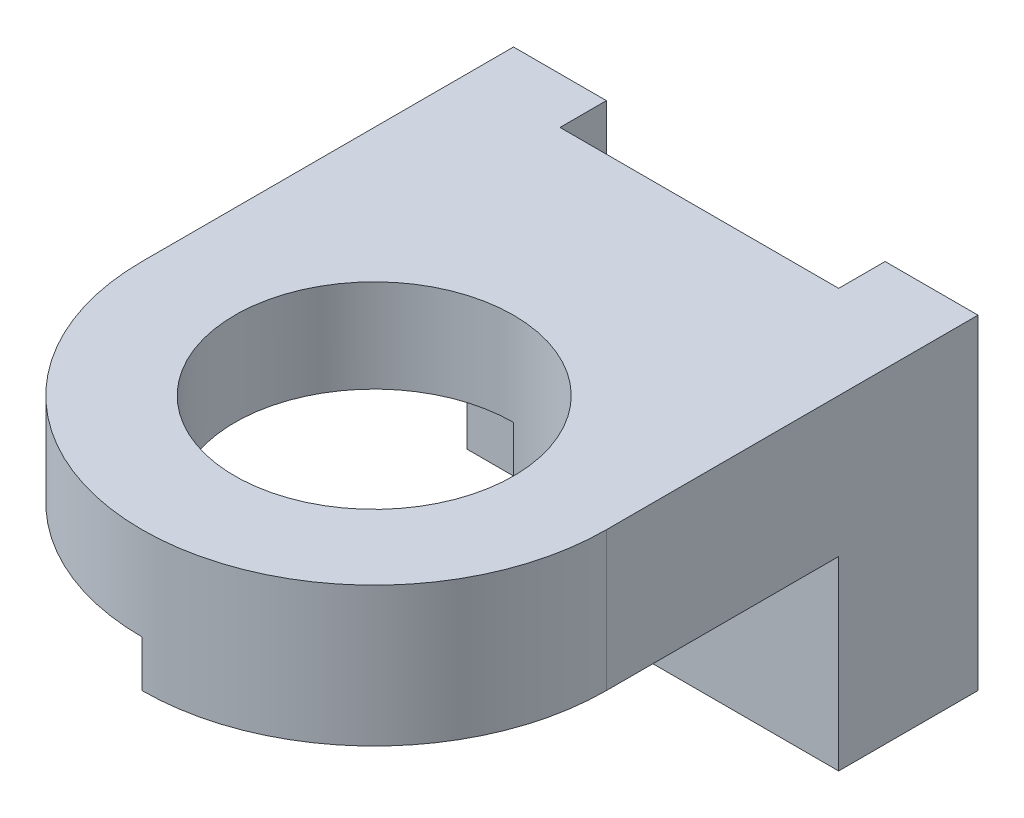
ISO-10303-21;
HEADER;
FILE_DESCRIPTION(('STEP AP214'),'2;1');
FILE_NAME('part.step','',(''),(''),'','','');
FILE_SCHEMA(('AUTOMOTIVE_DESIGN { 1 0 10303 214 1 1 1 1 }'));
ENDSEC;
DATA;
#1=APPLICATION_CONTEXT('core data for automotive mechanical design processes');
#2=APPLICATION_PROTOCOL_DEFINITION('international standard','automotive_design',2000,#1);
#3=PRODUCT_CONTEXT('',#1,'mechanical');
#4=PRODUCT('Part','Part','',(#3));
#5=PRODUCT_RELATED_PRODUCT_CATEGORY('part','',(#4));
#6=PRODUCT_DEFINITION_FORMATION('','',#4);
#7=PRODUCT_DEFINITION_CONTEXT('part definition',#1,'design');
#8=PRODUCT_DEFINITION('design','',#6,#7);
#9=PRODUCT_DEFINITION_SHAPE('','',#8);
#10=(LENGTH_UNIT() NAMED_UNIT(*) SI_UNIT(.MILLI.,.METRE.));
#11=(NAMED_UNIT(*) PLANE_ANGLE_UNIT() SI_UNIT($,.RADIAN.));
#12=(NAMED_UNIT(*) SI_UNIT($,.STERADIAN.) SOLID_ANGLE_UNIT());
#13=UNCERTAINTY_MEASURE_WITH_UNIT(LENGTH_MEASURE(1.E-05),#10,'distance_accuracy_value','');
#14=(GEOMETRIC_REPRESENTATION_CONTEXT(3) GLOBAL_UNCERTAINTY_ASSIGNED_CONTEXT((#13)) GLOBAL_UNIT_ASSIGNED_CONTEXT((#10,
#11,#12)) REPRESENTATION_CONTEXT('',''));
#15=CARTESIAN_POINT('',(0.,0.,0.));
#16=DIRECTION('',(0.,0.,1.));
#17=DIRECTION('',(1.,0.,0.));
#18=AXIS2_PLACEMENT_3D('',#15,#16,#17);
#19=CARTESIAN_POINT('',(0.,0.,0.));
#20=DIRECTION('',(0.,0.,-1.));
#21=DIRECTION('',(-1.,0.,0.));
#22=AXIS2_PLACEMENT_3D('',#19,#20,#21);
#23=PLANE('',#22);
#24=DIRECTION('',(-1.,0.,0.));
#25=VECTOR('',#24,1.);
#26=CARTESIAN_POINT('',(0.,70.,0.));
#27=LINE('',#26,#25);
#28=CARTESIAN_POINT('',(20.,70.,0.));
#29=VERTEX_POINT('',#28);
#30=CARTESIAN_POINT('',(0.,70.,0.));
#31=VERTEX_POINT('',#30);
#32=EDGE_CURVE('E178',#29,#31,#27,.T.);
#33=ORIENTED_EDGE('',*,*,#32,.F.);
#34=DIRECTION('',(0.,1.,0.));
#35=VECTOR('',#34,1.);
#36=CARTESIAN_POINT('',(20.,-70.,0.));
#37=LINE('',#36,#35);
#38=CARTESIAN_POINT('',(20.,20.,0.));
#39=VERTEX_POINT('',#38);
#40=EDGE_CURVE('E161',#39,#29,#37,.T.);
#41=ORIENTED_EDGE('',*,*,#40,.F.);
#42=DIRECTION('',(-1.,0.,0.));
#43=VECTOR('',#42,1.);
#44=CARTESIAN_POINT('',(0.,20.,0.));
#45=LINE('',#44,#43);
#46=CARTESIAN_POINT('',(0.,20.,0.));
#47=VERTEX_POINT('',#46);
#48=EDGE_CURVE('E267',#39,#47,#45,.T.);
#49=ORIENTED_EDGE('',*,*,#48,.T.);
#50=DIRECTION('',(0.,-1.,0.));
#51=VECTOR('',#50,1.);
#52=CARTESIAN_POINT('',(0.,0.,0.));
#53=LINE('',#52,#51);
#54=EDGE_CURVE('E182',#31,#47,#53,.T.);
#55=ORIENTED_EDGE('',*,*,#54,.F.);
#56=EDGE_LOOP('',(#33,#41,#49,#55));
#57=FACE_BOUND('',#56,.T.);
#58=ADVANCED_FACE('F35',(#57),#23,.T.);
#59=CARTESIAN_POINT('',(0.,0.,40.));
#60=DIRECTION('',(0.,0.,-1.));
#61=DIRECTION('',(-1.,0.,0.));
#62=AXIS2_PLACEMENT_3D('',#59,#60,#61);
#63=PLANE('',#62);
#64=DIRECTION('',(0.,1.,0.));
#65=VECTOR('',#64,1.);
#66=CARTESIAN_POINT('',(49.9999999999997,40.,40.));
#67=LINE('',#66,#65);
#68=CARTESIAN_POINT('',(49.9999999999997,40.,40.));
#69=VERTEX_POINT('',#68);
#70=CARTESIAN_POINT('',(49.9999999999997,50.,40.));
#71=VERTEX_POINT('',#70);
#72=EDGE_CURVE('E357',#69,#71,#67,.T.);
#73=ORIENTED_EDGE('',*,*,#72,.T.);
#74=DIRECTION('',(-1.,0.,0.));
#75=VECTOR('',#74,1.);
#76=CARTESIAN_POINT('',(100.,50.,40.));
#77=LINE('',#76,#75);
#78=CARTESIAN_POINT('',(30.,50.,40.));
#79=VERTEX_POINT('',#78);
#80=EDGE_CURVE('E213',#71,#79,#77,.T.);
#81=ORIENTED_EDGE('',*,*,#80,.T.);
#82=DIRECTION('',(0.,-1.,0.));
#83=VECTOR('',#82,1.);
#84=CARTESIAN_POINT('',(30.,0.,40.));
#85=LINE('',#84,#83);
#86=CARTESIAN_POINT('',(30.,40.,40.));
#87=VERTEX_POINT('',#86);
#88=EDGE_CURVE('E219',#79,#87,#85,.T.);
#89=ORIENTED_EDGE('',*,*,#88,.T.);
#90=DIRECTION('',(1.,0.,0.));
#91=VECTOR('',#90,1.);
#92=CARTESIAN_POINT('',(100.,40.,40.));
#93=LINE('',#92,#91);
#94=EDGE_CURVE('E210',#87,#69,#93,.T.);
#95=ORIENTED_EDGE('',*,*,#94,.T.);
#96=EDGE_LOOP('',(#73,#81,#89,#95));
#97=FACE_BOUND('',#96,.T.);
#98=ADVANCED_FACE('F356',(#97),#63,.F.);
#99=CARTESIAN_POINT('',(0.,50.,0.));
#100=DIRECTION('',(0.,1.,0.));
#101=DIRECTION('',(0.,0.,1.));
#102=AXIS2_PLACEMENT_3D('',#99,#100,#101);
#103=PLANE('',#102);
#104=DIRECTION('',(0.,0.,-1.));
#105=VECTOR('',#104,1.);
#106=CARTESIAN_POINT('',(50.,50.,110.));
#107=LINE('',#106,#105);
#108=CARTESIAN_POINT('',(50.,50.,130.));
#109=VERTEX_POINT('',#108);
#110=CARTESIAN_POINT('',(50.,50.,110.));
#111=VERTEX_POINT('',#110);
#112=EDGE_CURVE('E306',#109,#111,#107,.T.);
#113=ORIENTED_EDGE('',*,*,#112,.F.);
#114=CARTESIAN_POINT('',(50.,50.,80.));
#115=DIRECTION('',(0.,-1.,0.));
#116=DIRECTION('',(0.,0.,-1.));
#117=AXIS2_PLACEMENT_3D('',#114,#115,#116);
#118=CIRCLE('',#117,50.);
#119=CARTESIAN_POINT('',(0.,50.,80.));
#120=VERTEX_POINT('',#119);
#121=EDGE_CURVE('E303',#120,#109,#118,.F.);
#122=ORIENTED_EDGE('',*,*,#121,.F.);
#123=DIRECTION('',(0.,0.,1.));
#124=VECTOR('',#123,1.);
#125=CARTESIAN_POINT('',(0.,50.,0.));
#126=LINE('',#125,#124);
#127=CARTESIAN_POINT('',(0.,50.,10.));
#128=VERTEX_POINT('',#127);
#129=EDGE_CURVE('E195',#128,#120,#126,.T.);
#130=ORIENTED_EDGE('',*,*,#129,.F.);
#131=DIRECTION('',(-0.707106781186547,0.,-0.707106781186547));
#132=VECTOR('',#131,1.);
#133=CARTESIAN_POINT('',(0.,50.,10.));
#134=LINE('',#133,#132);
#135=EDGE_CURVE('E188',#79,#128,#134,.T.);
#136=ORIENTED_EDGE('',*,*,#135,.F.);
#137=ORIENTED_EDGE('',*,*,#80,.F.);
#138=DIRECTION('',(0.,0.,-1.));
#139=VECTOR('',#138,1.);
#140=CARTESIAN_POINT('',(49.9999999999997,50.,40.));
#141=LINE('',#140,#139);
#142=CARTESIAN_POINT('',(50.,50.,50.));
#143=VERTEX_POINT('',#142);
#144=EDGE_CURVE('E359',#143,#71,#141,.T.);
#145=ORIENTED_EDGE('',*,*,#144,.F.);
#146=CARTESIAN_POINT('',(50.,50.,80.));
#147=DIRECTION('',(0.,-1.,0.));
#148=DIRECTION('',(0.,0.,-1.));
#149=AXIS2_PLACEMENT_3D('',#146,#147,#148);
#150=CIRCLE('',#149,30.);
#151=EDGE_CURVE('E324',#111,#143,#150,.T.);
#152=ORIENTED_EDGE('',*,*,#151,.F.);
#153=EDGE_LOOP('',(#113,#122,#130,#136,#137,#145,#152));
#154=FACE_BOUND('',#153,.T.);
#155=ADVANCED_FACE('F300',(#154),#103,.F.);
#156=CARTESIAN_POINT('',(100.,0.,30.));
#157=DIRECTION('',(-1.,0.,0.));
#158=DIRECTION('',(0.,0.,1.));
#159=AXIS2_PLACEMENT_3D('',#156,#157,#158);
#160=PLANE('',#159);
#161=DIRECTION('',(0.,-1.,0.));
#162=VECTOR('',#161,1.);
#163=CARTESIAN_POINT('',(100.,70.,80.));
#164=LINE('',#163,#162);
#165=CARTESIAN_POINT('',(100.,70.,80.));
#166=VERTEX_POINT('',#165);
#167=CARTESIAN_POINT('',(100.,40.,80.));
#168=VERTEX_POINT('',#167);
#169=EDGE_CURVE('E320',#166,#168,#164,.T.);
#170=ORIENTED_EDGE('',*,*,#169,.T.);
#171=DIRECTION('',(0.,0.,-1.));
#172=VECTOR('',#171,1.);
#173=CARTESIAN_POINT('',(100.,40.,40.));
#174=LINE('',#173,#172);
#175=CARTESIAN_POINT('',(100.,40.,30.));
#176=VERTEX_POINT('',#175);
#177=EDGE_CURVE('E229',#168,#176,#174,.T.);
#178=ORIENTED_EDGE('',*,*,#177,.T.);
#179=DIRECTION('',(0.,1.,0.));
#180=VECTOR('',#179,1.);
#181=CARTESIAN_POINT('',(100.,0.,30.));
#182=LINE('',#181,#180);
#183=CARTESIAN_POINT('',(100.,0.,30.));
#184=VERTEX_POINT('',#183);
#185=EDGE_CURVE('E254',#184,#176,#182,.T.);
#186=ORIENTED_EDGE('',*,*,#185,.F.);
#187=DIRECTION('',(0.,0.,-1.));
#188=VECTOR('',#187,1.);
#189=CARTESIAN_POINT('',(100.,0.,30.));
#190=LINE('',#189,#188);
#191=CARTESIAN_POINT('',(100.,0.,0.));
#192=VERTEX_POINT('',#191);
#193=EDGE_CURVE('E251',#184,#192,#190,.T.);
#194=ORIENTED_EDGE('',*,*,#193,.T.);
#195=DIRECTION('',(0.,1.,0.));
#196=VECTOR('',#195,1.);
#197=CARTESIAN_POINT('',(100.,0.,0.));
#198=LINE('',#197,#196);
#199=CARTESIAN_POINT('',(100.,70.,0.));
#200=VERTEX_POINT('',#199);
#201=EDGE_CURVE('E243',#192,#200,#198,.T.);
#202=ORIENTED_EDGE('',*,*,#201,.T.);
#203=DIRECTION('',(0.,0.,-1.));
#204=VECTOR('',#203,1.);
#205=CARTESIAN_POINT('',(100.,70.,0.));
#206=LINE('',#205,#204);
#207=EDGE_CURVE('E185',#166,#200,#206,.T.);
#208=ORIENTED_EDGE('',*,*,#207,.F.);
#209=EDGE_LOOP('',(#170,#178,#186,#194,#202,#208));
#210=FACE_BOUND('',#209,.T.);
#211=ADVANCED_FACE('F330',(#210),#160,.F.);
#212=CARTESIAN_POINT('',(0.,0.,30.));
#213=DIRECTION('',(0.,0.,-1.));
#214=DIRECTION('',(-1.,0.,0.));
#215=AXIS2_PLACEMENT_3D('',#212,#213,#214);
#216=PLANE('',#215);
#217=DIRECTION('',(1.,0.,0.));
#218=VECTOR('',#217,1.);
#219=CARTESIAN_POINT('',(100.,40.,30.));
#220=LINE('',#219,#218);
#221=CARTESIAN_POINT('',(20.,40.,30.));
#222=VERTEX_POINT('',#221);
#223=EDGE_CURVE('E207',#222,#176,#220,.T.);
#224=ORIENTED_EDGE('',*,*,#223,.F.);
#225=DIRECTION('',(0.,-1.,0.));
#226=VECTOR('',#225,1.);
#227=CARTESIAN_POINT('',(20.,0.,30.));
#228=LINE('',#227,#226);
#229=CARTESIAN_POINT('',(20.,20.,30.));
#230=VERTEX_POINT('',#229);
#231=EDGE_CURVE('E200',#222,#230,#228,.T.);
#232=ORIENTED_EDGE('',*,*,#231,.T.);
#233=DIRECTION('',(-1.,0.,0.));
#234=VECTOR('',#233,1.);
#235=CARTESIAN_POINT('',(0.,20.,30.));
#236=LINE('',#235,#234);
#237=CARTESIAN_POINT('',(50.,20.,30.));
#238=VERTEX_POINT('',#237);
#239=EDGE_CURVE('E271',#238,#230,#236,.T.);
#240=ORIENTED_EDGE('',*,*,#239,.F.);
#241=DIRECTION('',(0.,1.,0.));
#242=VECTOR('',#241,1.);
#243=CARTESIAN_POINT('',(50.,0.,30.));
#244=LINE('',#243,#242);
#245=CARTESIAN_POINT('',(50.,0.,30.));
#246=VERTEX_POINT('',#245);
#247=EDGE_CURVE('E238',#246,#238,#244,.T.);
#248=ORIENTED_EDGE('',*,*,#247,.F.);
#249=DIRECTION('',(1.,0.,0.));
#250=VECTOR('',#249,1.);
#251=CARTESIAN_POINT('',(0.,0.,30.));
#252=LINE('',#251,#250);
#253=EDGE_CURVE('E245',#246,#184,#252,.T.);
#254=ORIENTED_EDGE('',*,*,#253,.T.);
#255=ORIENTED_EDGE('',*,*,#185,.T.);
#256=EDGE_LOOP('',(#224,#232,#240,#248,#254,#255));
#257=FACE_BOUND('',#256,.T.);
#258=ADVANCED_FACE('F338',(#257),#216,.F.);
#259=CARTESIAN_POINT('',(0.,0.,30.));
#260=DIRECTION('',(1.,0.,0.));
#261=DIRECTION('',(0.,0.,-1.));
#262=AXIS2_PLACEMENT_3D('',#259,#260,#261);
#263=PLANE('',#262);
#264=ORIENTED_EDGE('',*,*,#129,.T.);
#265=DIRECTION('',(0.,-1.,0.));
#266=VECTOR('',#265,1.);
#267=CARTESIAN_POINT('',(0.,70.,80.));
#268=LINE('',#267,#266);
#269=CARTESIAN_POINT('',(0.,70.,80.));
#270=VERTEX_POINT('',#269);
#271=EDGE_CURVE('E310',#270,#120,#268,.T.);
#272=ORIENTED_EDGE('',*,*,#271,.F.);
#273=DIRECTION('',(0.,0.,1.));
#274=VECTOR('',#273,1.);
#275=CARTESIAN_POINT('',(0.,70.,0.));
#276=LINE('',#275,#274);
#277=EDGE_CURVE('E189',#31,#270,#276,.T.);
#278=ORIENTED_EDGE('',*,*,#277,.F.);
#279=ORIENTED_EDGE('',*,*,#54,.T.);
#280=DIRECTION('',(0.,0.,1.));
#281=VECTOR('',#280,1.);
#282=CARTESIAN_POINT('',(0.,20.,0.));
#283=LINE('',#282,#281);
#284=CARTESIAN_POINT('',(0.,20.,10.));
#285=VERTEX_POINT('',#284);
#286=EDGE_CURVE('E247',#47,#285,#283,.T.);
#287=ORIENTED_EDGE('',*,*,#286,.T.);
#288=DIRECTION('',(0.,1.,0.));
#289=VECTOR('',#288,1.);
#290=CARTESIAN_POINT('',(0.,4.99999999999999,10.));
#291=LINE('',#290,#289);
#292=EDGE_CURVE('E201',#285,#128,#291,.T.);
#293=ORIENTED_EDGE('',*,*,#292,.T.);
#294=EDGE_LOOP('',(#264,#272,#278,#279,#287,#293));
#295=FACE_BOUND('',#294,.T.);
#296=ADVANCED_FACE('F37',(#295),#263,.F.);
#297=CARTESIAN_POINT('',(0.,0.,30.));
#298=DIRECTION('',(0.,1.,0.));
#299=DIRECTION('',(0.,0.,1.));
#300=AXIS2_PLACEMENT_3D('',#297,#298,#299);
#301=PLANE('',#300);
#302=DIRECTION('',(1.,0.,0.));
#303=VECTOR('',#302,1.);
#304=CARTESIAN_POINT('',(0.,0.,10.));
#305=LINE('',#304,#303);
#306=CARTESIAN_POINT('',(50.,0.,10.));
#307=VERTEX_POINT('',#306);
#308=CARTESIAN_POINT('',(80.,0.,10.));
#309=VERTEX_POINT('',#308);
#310=EDGE_CURVE('E237',#307,#309,#305,.T.);
#311=ORIENTED_EDGE('',*,*,#310,.T.);
#312=DIRECTION('',(0.,0.,-1.));
#313=VECTOR('',#312,1.);
#314=CARTESIAN_POINT('',(80.,0.,30.));
#315=LINE('',#314,#313);
#316=CARTESIAN_POINT('',(80.,0.,0.));
#317=VERTEX_POINT('',#316);
#318=EDGE_CURVE('E226',#309,#317,#315,.T.);
#319=ORIENTED_EDGE('',*,*,#318,.T.);
#320=DIRECTION('',(1.,0.,0.));
#321=VECTOR('',#320,1.);
#322=CARTESIAN_POINT('',(0.,0.,0.));
#323=LINE('',#322,#321);
#324=EDGE_CURVE('E234',#317,#192,#323,.T.);
#325=ORIENTED_EDGE('',*,*,#324,.T.);
#326=ORIENTED_EDGE('',*,*,#193,.F.);
#327=ORIENTED_EDGE('',*,*,#253,.F.);
#328=DIRECTION('',(0.,0.,1.));
#329=VECTOR('',#328,1.);
#330=CARTESIAN_POINT('',(50.,0.,0.));
#331=LINE('',#330,#329);
#332=EDGE_CURVE('E264',#307,#246,#331,.T.);
#333=ORIENTED_EDGE('',*,*,#332,.F.);
#334=EDGE_LOOP('',(#311,#319,#325,#326,#327,#333));
#335=FACE_BOUND('',#334,.T.);
#336=ADVANCED_FACE('F232',(#335),#301,.F.);
#337=DIRECTION('',(0.,1.,0.));
#338=VECTOR('',#337,1.);
#339=CARTESIAN_POINT('',(80.,-70.,0.));
#340=LINE('',#339,#338);
#341=CARTESIAN_POINT('',(80.,70.,0.));
#342=VERTEX_POINT('',#341);
#343=EDGE_CURVE('E172',#317,#342,#340,.T.);
#344=ORIENTED_EDGE('',*,*,#343,.T.);
#345=EDGE_CURVE('E184',#200,#342,#27,.T.);
#346=ORIENTED_EDGE('',*,*,#345,.F.);
#347=ORIENTED_EDGE('',*,*,#201,.F.);
#348=ORIENTED_EDGE('',*,*,#324,.F.);
#349=EDGE_LOOP('',(#344,#346,#347,#348));
#350=FACE_BOUND('',#349,.T.);
#351=ADVANCED_FACE('F241',(#350),#23,.T.);
#352=CARTESIAN_POINT('',(0.,20.,0.));
#353=DIRECTION('',(0.,1.,0.));
#354=DIRECTION('',(0.,0.,1.));
#355=AXIS2_PLACEMENT_3D('',#352,#353,#354);
#356=PLANE('',#355);
#357=ORIENTED_EDGE('',*,*,#239,.T.);
#358=DIRECTION('',(-0.707106781186548,0.,-0.707106781186548));
#359=VECTOR('',#358,1.);
#360=CARTESIAN_POINT('',(-5.,20.,5.));
#361=LINE('',#360,#359);
#362=EDGE_CURVE('E204',#230,#285,#361,.T.);
#363=ORIENTED_EDGE('',*,*,#362,.T.);
#364=ORIENTED_EDGE('',*,*,#286,.F.);
#365=ORIENTED_EDGE('',*,*,#48,.F.);
#366=DIRECTION('',(0.,0.,1.));
#367=VECTOR('',#366,1.);
#368=CARTESIAN_POINT('',(20.,20.,0.));
#369=LINE('',#368,#367);
#370=CARTESIAN_POINT('',(20.,20.,10.));
#371=VERTEX_POINT('',#370);
#372=EDGE_CURVE('E167',#39,#371,#369,.T.);
#373=ORIENTED_EDGE('',*,*,#372,.T.);
#374=DIRECTION('',(1.,0.,0.));
#375=VECTOR('',#374,1.);
#376=CARTESIAN_POINT('',(0.,20.,10.));
#377=LINE('',#376,#375);
#378=CARTESIAN_POINT('',(50.,20.,10.));
#379=VERTEX_POINT('',#378);
#380=EDGE_CURVE('E278',#371,#379,#377,.T.);
#381=ORIENTED_EDGE('',*,*,#380,.T.);
#382=DIRECTION('',(0.,0.,1.));
#383=VECTOR('',#382,1.);
#384=CARTESIAN_POINT('',(50.,20.,0.));
#385=LINE('',#384,#383);
#386=EDGE_CURVE('E266',#379,#238,#385,.T.);
#387=ORIENTED_EDGE('',*,*,#386,.T.);
#388=EDGE_LOOP('',(#357,#363,#364,#365,#373,#381,#387));
#389=FACE_BOUND('',#388,.T.);
#390=ADVANCED_FACE('F344',(#389),#356,.F.);
#391=CARTESIAN_POINT('',(50.,0.,0.));
#392=DIRECTION('',(1.,0.,0.));
#393=DIRECTION('',(0.,0.,-1.));
#394=AXIS2_PLACEMENT_3D('',#391,#392,#393);
#395=PLANE('',#394);
#396=ORIENTED_EDGE('',*,*,#386,.F.);
#397=DIRECTION('',(0.,-1.,0.));
#398=VECTOR('',#397,1.);
#399=CARTESIAN_POINT('',(50.,0.,10.));
#400=LINE('',#399,#398);
#401=EDGE_CURVE('E253',#379,#307,#400,.T.);
#402=ORIENTED_EDGE('',*,*,#401,.T.);
#403=ORIENTED_EDGE('',*,*,#332,.T.);
#404=ORIENTED_EDGE('',*,*,#247,.T.);
#405=EDGE_LOOP('',(#396,#402,#403,#404));
#406=FACE_BOUND('',#405,.T.);
#407=ADVANCED_FACE('F342',(#406),#395,.F.);
#408=CARTESIAN_POINT('',(80.,-70.,0.));
#409=DIRECTION('',(1.,0.,0.));
#410=DIRECTION('',(0.,0.,-1.));
#411=AXIS2_PLACEMENT_3D('',#408,#409,#410);
#412=PLANE('',#411);
#413=DIRECTION('',(0.,1.,0.));
#414=VECTOR('',#413,1.);
#415=CARTESIAN_POINT('',(80.,-70.,10.));
#416=LINE('',#415,#414);
#417=CARTESIAN_POINT('',(80.,70.,10.));
#418=VERTEX_POINT('',#417);
#419=EDGE_CURVE('E50',#309,#418,#416,.T.);
#420=ORIENTED_EDGE('',*,*,#419,.T.);
#421=DIRECTION('',(0.,0.,-1.));
#422=VECTOR('',#421,1.);
#423=CARTESIAN_POINT('',(80.,70.,0.));
#424=LINE('',#423,#422);
#425=EDGE_CURVE('E218',#418,#342,#424,.T.);
#426=ORIENTED_EDGE('',*,*,#425,.T.);
#427=ORIENTED_EDGE('',*,*,#343,.F.);
#428=ORIENTED_EDGE('',*,*,#318,.F.);
#429=EDGE_LOOP('',(#420,#426,#427,#428));
#430=FACE_BOUND('',#429,.T.);
#431=ADVANCED_FACE('F224',(#430),#412,.F.);
#432=CARTESIAN_POINT('',(20.,-70.,0.));
#433=DIRECTION('',(-1.,0.,0.));
#434=DIRECTION('',(0.,0.,1.));
#435=AXIS2_PLACEMENT_3D('',#432,#433,#434);
#436=PLANE('',#435);
#437=ORIENTED_EDGE('',*,*,#40,.T.);
#438=DIRECTION('',(0.,0.,1.));
#439=VECTOR('',#438,1.);
#440=CARTESIAN_POINT('',(20.,70.,0.));
#441=LINE('',#440,#439);
#442=CARTESIAN_POINT('',(20.,70.,10.));
#443=VERTEX_POINT('',#442);
#444=EDGE_CURVE('E11',#29,#443,#441,.T.);
#445=ORIENTED_EDGE('',*,*,#444,.T.);
#446=DIRECTION('',(0.,1.,0.));
#447=VECTOR('',#446,1.);
#448=CARTESIAN_POINT('',(20.,-70.,10.));
#449=LINE('',#448,#447);
#450=EDGE_CURVE('E171',#371,#443,#449,.T.);
#451=ORIENTED_EDGE('',*,*,#450,.F.);
#452=ORIENTED_EDGE('',*,*,#372,.F.);
#453=EDGE_LOOP('',(#437,#445,#451,#452));
#454=FACE_BOUND('',#453,.T.);
#455=ADVANCED_FACE('F163',(#454),#436,.F.);
#456=CARTESIAN_POINT('',(80.,-70.,10.));
#457=DIRECTION('',(0.,0.,1.));
#458=DIRECTION('',(1.,0.,0.));
#459=AXIS2_PLACEMENT_3D('',#456,#457,#458);
#460=PLANE('',#459);
#461=ORIENTED_EDGE('',*,*,#401,.F.);
#462=ORIENTED_EDGE('',*,*,#380,.F.);
#463=ORIENTED_EDGE('',*,*,#450,.T.);
#464=DIRECTION('',(1.,0.,0.));
#465=VECTOR('',#464,1.);
#466=CARTESIAN_POINT('',(0.,70.,10.));
#467=LINE('',#466,#465);
#468=EDGE_CURVE('E43',#443,#418,#467,.T.);
#469=ORIENTED_EDGE('',*,*,#468,.T.);
#470=ORIENTED_EDGE('',*,*,#419,.F.);
#471=ORIENTED_EDGE('',*,*,#310,.F.);
#472=EDGE_LOOP('',(#461,#462,#463,#469,#470,#471));
#473=FACE_BOUND('',#472,.T.);
#474=ADVANCED_FACE('F221',(#473),#460,.F.);
#475=CARTESIAN_POINT('',(100.,40.,40.));
#476=DIRECTION('',(0.,1.,0.));
#477=DIRECTION('',(-1.,0.,0.));
#478=AXIS2_PLACEMENT_3D('',#475,#476,#477);
#479=PLANE('',#478);
#480=ORIENTED_EDGE('',*,*,#94,.F.);
#481=DIRECTION('',(-0.707106781186548,0.,-0.707106781186548));
#482=VECTOR('',#481,1.);
#483=CARTESIAN_POINT('',(65.,40.,75.));
#484=LINE('',#483,#482);
#485=EDGE_CURVE('E58',#87,#222,#484,.T.);
#486=ORIENTED_EDGE('',*,*,#485,.T.);
#487=ORIENTED_EDGE('',*,*,#223,.T.);
#488=ORIENTED_EDGE('',*,*,#177,.F.);
#489=CARTESIAN_POINT('',(50.,40.,80.));
#490=DIRECTION('',(0.,-1.,0.));
#491=DIRECTION('',(0.,0.,1.));
#492=AXIS2_PLACEMENT_3D('',#489,#490,#491);
#493=CIRCLE('',#492,50.);
#494=CARTESIAN_POINT('',(50.,40.,130.));
#495=VERTEX_POINT('',#494);
#496=EDGE_CURVE('E361',#168,#495,#493,.T.);
#497=ORIENTED_EDGE('',*,*,#496,.T.);
#498=DIRECTION('',(0.,0.,-1.));
#499=VECTOR('',#498,1.);
#500=CARTESIAN_POINT('',(50.,40.,110.));
#501=LINE('',#500,#499);
#502=CARTESIAN_POINT('',(50.,40.,110.));
#503=VERTEX_POINT('',#502);
#504=EDGE_CURVE('E378',#495,#503,#501,.T.);
#505=ORIENTED_EDGE('',*,*,#504,.T.);
#506=CARTESIAN_POINT('',(50.,40.,80.));
#507=DIRECTION('',(0.,1.,0.));
#508=DIRECTION('',(0.,0.,1.));
#509=AXIS2_PLACEMENT_3D('',#506,#507,#508);
#510=CIRCLE('',#509,30.);
#511=CARTESIAN_POINT('',(50.,40.,50.));
#512=VERTEX_POINT('',#511);
#513=EDGE_CURVE('E370',#503,#512,#510,.T.);
#514=ORIENTED_EDGE('',*,*,#513,.T.);
#515=DIRECTION('',(0.,0.,-1.));
#516=VECTOR('',#515,1.);
#517=CARTESIAN_POINT('',(49.9999999999997,40.,40.));
#518=LINE('',#517,#516);
#519=EDGE_CURVE('E352',#512,#69,#518,.T.);
#520=ORIENTED_EDGE('',*,*,#519,.T.);
#521=EDGE_LOOP('',(#480,#486,#487,#488,#497,#505,#514,#520));
#522=FACE_BOUND('',#521,.T.);
#523=ADVANCED_FACE('F348',(#522),#479,.F.);
#524=CARTESIAN_POINT('',(0.,4.99999999999999,10.));
#525=DIRECTION('',(0.707106781186547,0.,-0.707106781186547));
#526=DIRECTION('',(-0.707106781186548,0.,-0.707106781186548));
#527=AXIS2_PLACEMENT_3D('',#524,#525,#526);
#528=PLANE('',#527);
#529=ORIENTED_EDGE('',*,*,#231,.F.);
#530=ORIENTED_EDGE('',*,*,#485,.F.);
#531=ORIENTED_EDGE('',*,*,#88,.F.);
#532=ORIENTED_EDGE('',*,*,#135,.T.);
#533=ORIENTED_EDGE('',*,*,#292,.F.);
#534=ORIENTED_EDGE('',*,*,#362,.F.);
#535=EDGE_LOOP('',(#529,#530,#531,#532,#533,#534));
#536=FACE_BOUND('',#535,.T.);
#537=ADVANCED_FACE('F345',(#536),#528,.F.);
#538=CARTESIAN_POINT('',(0.,70.,0.));
#539=DIRECTION('',(0.,1.,0.));
#540=DIRECTION('',(0.,0.,1.));
#541=AXIS2_PLACEMENT_3D('',#538,#539,#540);
#542=PLANE('',#541);
#543=ORIENTED_EDGE('',*,*,#444,.F.);
#544=ORIENTED_EDGE('',*,*,#32,.T.);
#545=ORIENTED_EDGE('',*,*,#277,.T.);
#546=CARTESIAN_POINT('',(50.,70.,80.));
#547=DIRECTION('',(0.,-1.,0.));
#548=DIRECTION('',(0.,0.,-1.));
#549=AXIS2_PLACEMENT_3D('',#546,#547,#548);
#550=CIRCLE('',#549,50.);
#551=EDGE_CURVE('E309',#270,#166,#550,.F.);
#552=ORIENTED_EDGE('',*,*,#551,.T.);
#553=ORIENTED_EDGE('',*,*,#207,.T.);
#554=ORIENTED_EDGE('',*,*,#345,.T.);
#555=ORIENTED_EDGE('',*,*,#425,.F.);
#556=ORIENTED_EDGE('',*,*,#468,.F.);
#557=EDGE_LOOP('',(#543,#544,#545,#552,#553,#554,#555,#556));
#558=FACE_BOUND('',#557,.T.);
#559=CARTESIAN_POINT('',(50.,70.,80.));
#560=DIRECTION('',(0.,-1.,0.));
#561=DIRECTION('',(0.,0.,-1.));
#562=AXIS2_PLACEMENT_3D('',#559,#560,#561);
#563=CIRCLE('',#562,30.);
#564=CARTESIAN_POINT('',(50.,70.,50.));
#565=VERTEX_POINT('',#564);
#566=EDGE_CURVE('E198',#565,#565,#563,.T.);
#567=ORIENTED_EDGE('',*,*,#566,.T.);
#568=EDGE_LOOP('',(#567));
#569=FACE_BOUND('',#568,.T.);
#570=ADVANCED_FACE('F175',(#558,#569),#542,.T.);
#571=CARTESIAN_POINT('',(50.,70.,80.));
#572=DIRECTION('',(0.,-1.,0.));
#573=DIRECTION('',(0.,0.,-1.));
#574=AXIS2_PLACEMENT_3D('',#571,#572,#573);
#575=CYLINDRICAL_SURFACE('',#574,30.);
#576=ORIENTED_EDGE('',*,*,#566,.F.);
#577=EDGE_LOOP('',(#576));
#578=FACE_BOUND('',#577,.T.);
#579=ORIENTED_EDGE('',*,*,#151,.T.);
#580=DIRECTION('',(0.,1.,0.));
#581=VECTOR('',#580,1.);
#582=CARTESIAN_POINT('',(50.,40.,50.));
#583=LINE('',#582,#581);
#584=EDGE_CURVE('E368',#512,#143,#583,.T.);
#585=ORIENTED_EDGE('',*,*,#584,.F.);
#586=ORIENTED_EDGE('',*,*,#513,.F.);
#587=DIRECTION('',(0.,1.,0.));
#588=VECTOR('',#587,1.);
#589=CARTESIAN_POINT('',(50.,40.,110.));
#590=LINE('',#589,#588);
#591=EDGE_CURVE('E316',#503,#111,#590,.T.);
#592=ORIENTED_EDGE('',*,*,#591,.T.);
#593=EDGE_LOOP('',(#579,#585,#586,#592));
#594=FACE_BOUND('',#593,.T.);
#595=ADVANCED_FACE('F366',(#578,#594),#575,.F.);
#596=CARTESIAN_POINT('',(50.,70.,80.));
#597=DIRECTION('',(0.,-1.,0.));
#598=DIRECTION('',(0.,0.,-1.));
#599=AXIS2_PLACEMENT_3D('',#596,#597,#598);
#600=CYLINDRICAL_SURFACE('',#599,50.);
#601=ORIENTED_EDGE('',*,*,#121,.T.);
#602=DIRECTION('',(0.,1.,0.));
#603=VECTOR('',#602,1.);
#604=CARTESIAN_POINT('',(50.,40.,130.));
#605=LINE('',#604,#603);
#606=EDGE_CURVE('E314',#495,#109,#605,.T.);
#607=ORIENTED_EDGE('',*,*,#606,.F.);
#608=ORIENTED_EDGE('',*,*,#496,.F.);
#609=ORIENTED_EDGE('',*,*,#169,.F.);
#610=ORIENTED_EDGE('',*,*,#551,.F.);
#611=ORIENTED_EDGE('',*,*,#271,.T.);
#612=EDGE_LOOP('',(#601,#607,#608,#609,#610,#611));
#613=FACE_BOUND('',#612,.T.);
#614=ADVANCED_FACE('F312',(#613),#600,.T.);
#615=CARTESIAN_POINT('',(50.,40.,110.));
#616=DIRECTION('',(1.,0.,0.));
#617=DIRECTION('',(0.,0.,-1.));
#618=AXIS2_PLACEMENT_3D('',#615,#616,#617);
#619=PLANE('',#618);
#620=ORIENTED_EDGE('',*,*,#112,.T.);
#621=ORIENTED_EDGE('',*,*,#591,.F.);
#622=ORIENTED_EDGE('',*,*,#504,.F.);
#623=ORIENTED_EDGE('',*,*,#606,.T.);
#624=EDGE_LOOP('',(#620,#621,#622,#623));
#625=FACE_BOUND('',#624,.T.);
#626=ADVANCED_FACE('F380',(#625),#619,.F.);
#627=CARTESIAN_POINT('',(49.9999999999997,40.,40.));
#628=DIRECTION('',(1.,0.,0.));
#629=DIRECTION('',(0.,0.,-1.));
#630=AXIS2_PLACEMENT_3D('',#627,#628,#629);
#631=PLANE('',#630);
#632=ORIENTED_EDGE('',*,*,#144,.T.);
#633=ORIENTED_EDGE('',*,*,#72,.F.);
#634=ORIENTED_EDGE('',*,*,#519,.F.);
#635=ORIENTED_EDGE('',*,*,#584,.T.);
#636=EDGE_LOOP('',(#632,#633,#634,#635));
#637=FACE_BOUND('',#636,.T.);
#638=ADVANCED_FACE('F382',(#637),#631,.F.);
#639=CLOSED_SHELL('',(#58,#98,#155,#211,#258,#296,#336,#351,#390,#407,#431,#455,#474,#523,#537,
#570,#595,#614,#626,#638));
#640=MANIFOLD_SOLID_BREP('B2',#639);
#641=ADVANCED_BREP_SHAPE_REPRESENTATION('',(#18,#640),#14);
#642=SHAPE_DEFINITION_REPRESENTATION(#9,#641);
ENDSEC;
END-ISO-10303-21;
